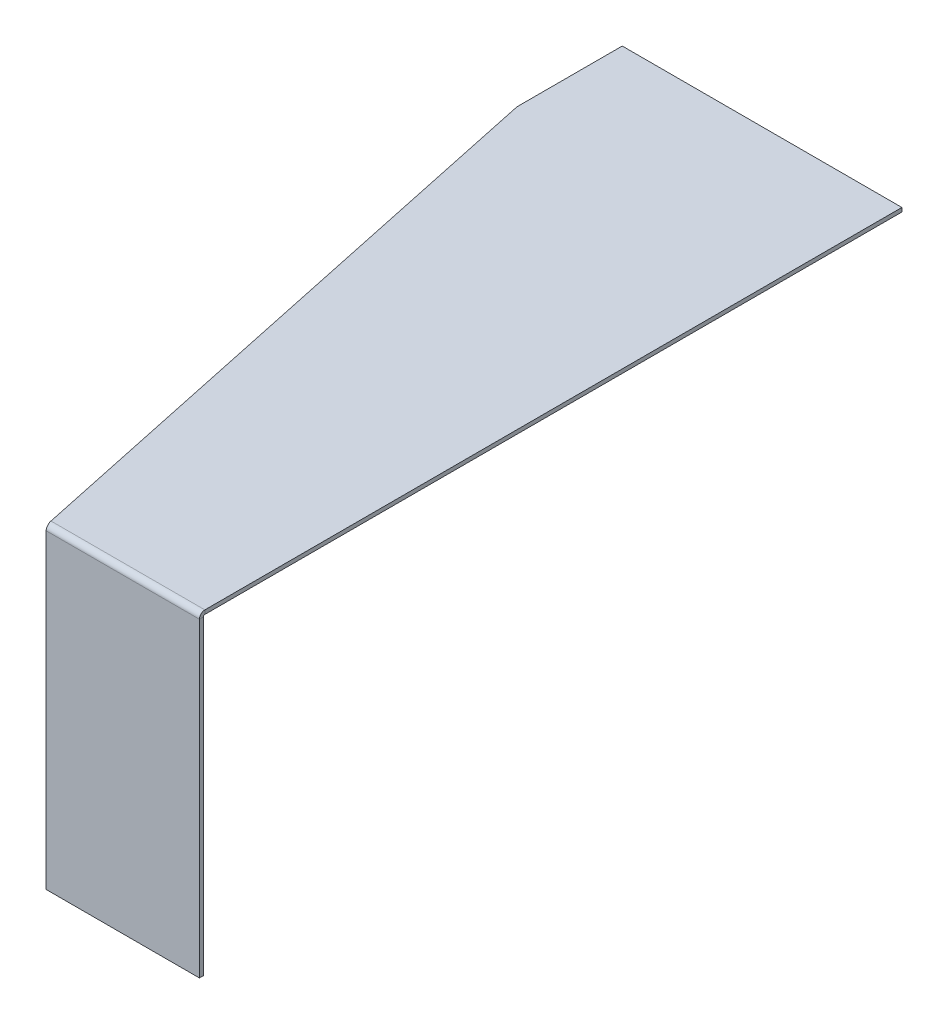
ISO-10303-21;
HEADER;
FILE_DESCRIPTION(('STEP AP214'),'2;1');
FILE_NAME('part.step','',(''),(''),'','','');
FILE_SCHEMA(('AUTOMOTIVE_DESIGN { 1 0 10303 214 1 1 1 1 }'));
ENDSEC;
DATA;
#1=APPLICATION_CONTEXT('core data for automotive mechanical design processes');
#2=APPLICATION_PROTOCOL_DEFINITION('international standard','automotive_design',2000,#1);
#3=PRODUCT_CONTEXT('',#1,'mechanical');
#4=PRODUCT('Part','Part','',(#3));
#5=PRODUCT_RELATED_PRODUCT_CATEGORY('part','',(#4));
#6=PRODUCT_DEFINITION_FORMATION('','',#4);
#7=PRODUCT_DEFINITION_CONTEXT('part definition',#1,'design');
#8=PRODUCT_DEFINITION('design','',#6,#7);
#9=PRODUCT_DEFINITION_SHAPE('','',#8);
#10=(LENGTH_UNIT() NAMED_UNIT(*) SI_UNIT(.MILLI.,.METRE.));
#11=(NAMED_UNIT(*) PLANE_ANGLE_UNIT() SI_UNIT($,.RADIAN.));
#12=(NAMED_UNIT(*) SI_UNIT($,.STERADIAN.) SOLID_ANGLE_UNIT());
#13=UNCERTAINTY_MEASURE_WITH_UNIT(LENGTH_MEASURE(1.E-05),#10,'distance_accuracy_value','');
#14=(GEOMETRIC_REPRESENTATION_CONTEXT(3) GLOBAL_UNCERTAINTY_ASSIGNED_CONTEXT((#13)) GLOBAL_UNIT_ASSIGNED_CONTEXT((#10,
#11,#12)) REPRESENTATION_CONTEXT('',''));
#15=CARTESIAN_POINT('',(0.,0.,0.));
#16=DIRECTION('',(0.,0.,1.));
#17=DIRECTION('',(1.,0.,0.));
#18=AXIS2_PLACEMENT_3D('',#15,#16,#17);
#19=CARTESIAN_POINT('',(-77.3703673668212,0.627322450556078,354.452092833276));
#20=DIRECTION('',(1.,0.,0.));
#21=DIRECTION('',(0.,1.,0.));
#22=AXIS2_PLACEMENT_3D('',#19,#20,#21);
#23=PLANE('',#22);
#24=DIRECTION('',(0.,-1.,0.));
#25=VECTOR('',#24,1.);
#26=CARTESIAN_POINT('',(-77.3703673668212,0.627322450556078,354.452092833276));
#27=LINE('',#26,#25);
#28=CARTESIAN_POINT('',(-77.3703673668212,-0.736599999999921,354.452092833276));
#29=VERTEX_POINT('',#28);
#30=CARTESIAN_POINT('',(-77.3703673668214,-157.506625406837,354.452092833275));
#31=VERTEX_POINT('',#30);
#32=EDGE_CURVE('E92',#29,#31,#27,.T.);
#33=ORIENTED_EDGE('',*,*,#32,.F.);
#34=DIRECTION('',(0.,0.,-1.));
#35=VECTOR('',#34,1.);
#36=CARTESIAN_POINT('',(-77.3703673668212,-0.736599999999976,354.452092833276));
#37=LINE('',#36,#35);
#38=CARTESIAN_POINT('',(-77.3703673668212,-0.736599999999976,352.452092833276));
#39=VERTEX_POINT('',#38);
#40=EDGE_CURVE('E12',#29,#39,#37,.T.);
#41=ORIENTED_EDGE('',*,*,#40,.T.);
#42=DIRECTION('',(0.,-1.,0.));
#43=VECTOR('',#42,1.);
#44=CARTESIAN_POINT('',(-77.3703673668212,0.627322450556078,352.452092833276));
#45=LINE('',#44,#43);
#46=CARTESIAN_POINT('',(-77.3703673668214,-157.506625406837,352.452092833275));
#47=VERTEX_POINT('',#46);
#48=EDGE_CURVE('E105',#39,#47,#45,.T.);
#49=ORIENTED_EDGE('',*,*,#48,.T.);
#50=DIRECTION('',(0.,0.,-1.));
#51=VECTOR('',#50,1.);
#52=CARTESIAN_POINT('',(-77.3703673668214,-157.506625406837,354.452092833275));
#53=LINE('',#52,#51);
#54=EDGE_CURVE('E329',#31,#47,#53,.T.);
#55=ORIENTED_EDGE('',*,*,#54,.F.);
#56=EDGE_LOOP('',(#33,#41,#49,#55));
#57=FACE_BOUND('',#56,.T.);
#58=ADVANCED_FACE('F89',(#57),#23,.F.);
#59=CARTESIAN_POINT('',(-2.24104759925885E-13,-157.506625406837,354.452092833275));
#60=DIRECTION('',(-1.,0.,0.));
#61=DIRECTION('',(0.,-1.,0.));
#62=AXIS2_PLACEMENT_3D('',#59,#60,#61);
#63=PLANE('',#62);
#64=DIRECTION('',(0.,1.,0.));
#65=VECTOR('',#64,1.);
#66=CARTESIAN_POINT('',(-2.2696394522702E-13,-157.506625406837,352.452092833275));
#67=LINE('',#66,#65);
#68=CARTESIAN_POINT('',(-2.2696394522702E-13,-157.506625406837,352.452092833275));
#69=VERTEX_POINT('',#68);
#70=CARTESIAN_POINT('',(0.,-0.736600000000032,352.452092833276));
#71=VERTEX_POINT('',#70);
#72=EDGE_CURVE('E112',#69,#71,#67,.T.);
#73=ORIENTED_EDGE('',*,*,#72,.T.);
#74=DIRECTION('',(0.,0.,1.));
#75=VECTOR('',#74,1.);
#76=CARTESIAN_POINT('',(0.,-0.736600000000032,354.452092833276));
#77=LINE('',#76,#75);
#78=CARTESIAN_POINT('',(0.,-0.736599999999881,354.452092833276));
#79=VERTEX_POINT('',#78);
#80=EDGE_CURVE('E343',#71,#79,#77,.T.);
#81=ORIENTED_EDGE('',*,*,#80,.T.);
#82=DIRECTION('',(0.,1.,0.));
#83=VECTOR('',#82,1.);
#84=CARTESIAN_POINT('',(-2.24104759925885E-13,-157.506625406837,354.452092833275));
#85=LINE('',#84,#83);
#86=CARTESIAN_POINT('',(-2.24104759925885E-13,-157.506625406837,354.452092833275));
#87=VERTEX_POINT('',#86);
#88=EDGE_CURVE('E332',#87,#79,#85,.T.);
#89=ORIENTED_EDGE('',*,*,#88,.F.);
#90=DIRECTION('',(0.,0.,-1.));
#91=VECTOR('',#90,1.);
#92=CARTESIAN_POINT('',(-2.24104759925885E-13,-157.506625406837,354.452092833275));
#93=LINE('',#92,#91);
#94=EDGE_CURVE('E333',#87,#69,#93,.T.);
#95=ORIENTED_EDGE('',*,*,#94,.T.);
#96=EDGE_LOOP('',(#73,#81,#89,#95));
#97=FACE_BOUND('',#96,.T.);
#98=ADVANCED_FACE('F316',(#97),#63,.F.);
#99=CARTESIAN_POINT('',(5.03862921591622E-13,353.706737734388,352.452092833277));
#100=DIRECTION('',(0.,0.,1.));
#101=DIRECTION('',(0.,-1.,0.));
#102=AXIS2_PLACEMENT_3D('',#99,#100,#101);
#103=PLANE('',#102);
#104=ORIENTED_EDGE('',*,*,#48,.F.);
#105=DIRECTION('',(1.,0.,0.));
#106=VECTOR('',#105,1.);
#107=CARTESIAN_POINT('',(2.51456863316356E-13,-0.736600000000032,352.452092833276));
#108=LINE('',#107,#106);
#109=EDGE_CURVE('E97',#39,#71,#108,.T.);
#110=ORIENTED_EDGE('',*,*,#109,.T.);
#111=ORIENTED_EDGE('',*,*,#72,.F.);
#112=DIRECTION('',(1.,0.,0.));
#113=VECTOR('',#112,1.);
#114=CARTESIAN_POINT('',(-77.3703673668214,-157.506625406837,352.452092833275));
#115=LINE('',#114,#113);
#116=EDGE_CURVE('E336',#47,#69,#115,.T.);
#117=ORIENTED_EDGE('',*,*,#116,.F.);
#118=EDGE_LOOP('',(#104,#110,#111,#117));
#119=FACE_BOUND('',#118,.T.);
#120=ADVANCED_FACE('F310',(#119),#103,.F.);
#121=CARTESIAN_POINT('',(-77.3703673668214,-157.506625406837,354.452092833275));
#122=DIRECTION('',(0.,1.,0.));
#123=DIRECTION('',(-1.,0.,0.));
#124=AXIS2_PLACEMENT_3D('',#121,#122,#123);
#125=PLANE('',#124);
#126=ORIENTED_EDGE('',*,*,#116,.T.);
#127=ORIENTED_EDGE('',*,*,#94,.F.);
#128=DIRECTION('',(1.,0.,0.));
#129=VECTOR('',#128,1.);
#130=CARTESIAN_POINT('',(-77.3703673668214,-157.506625406837,354.452092833275));
#131=LINE('',#130,#129);
#132=EDGE_CURVE('E331',#31,#87,#131,.T.);
#133=ORIENTED_EDGE('',*,*,#132,.F.);
#134=ORIENTED_EDGE('',*,*,#54,.T.);
#135=EDGE_LOOP('',(#126,#127,#133,#134));
#136=FACE_BOUND('',#135,.T.);
#137=ADVANCED_FACE('F306',(#136),#125,.F.);
#138=CARTESIAN_POINT('',(5.06722106892757E-13,353.706737734388,354.452092833277));
#139=DIRECTION('',(0.,0.,1.));
#140=DIRECTION('',(0.,-1.,0.));
#141=AXIS2_PLACEMENT_3D('',#138,#139,#140);
#142=PLANE('',#141);
#143=DIRECTION('',(1.,0.,0.));
#144=VECTOR('',#143,1.);
#145=CARTESIAN_POINT('',(2.54316048617491E-13,-0.736600000000032,354.452092833276));
#146=LINE('',#145,#144);
#147=EDGE_CURVE('E345',#29,#79,#146,.T.);
#148=ORIENTED_EDGE('',*,*,#147,.F.);
#149=ORIENTED_EDGE('',*,*,#32,.T.);
#150=ORIENTED_EDGE('',*,*,#132,.T.);
#151=ORIENTED_EDGE('',*,*,#88,.T.);
#152=EDGE_LOOP('',(#148,#149,#150,#151));
#153=FACE_BOUND('',#152,.T.);
#154=ADVANCED_FACE('F309',(#153),#142,.T.);
#155=CARTESIAN_POINT('',(-141.102892553405,2.,0.));
#156=DIRECTION('',(1.,0.,0.));
#157=DIRECTION('',(0.,0.,-1.));
#158=AXIS2_PLACEMENT_3D('',#155,#156,#157);
#159=PLANE('',#158);
#160=DIRECTION('',(0.,0.,1.));
#161=VECTOR('',#160,1.);
#162=CARTESIAN_POINT('',(-141.102892553405,0.,0.));
#163=LINE('',#162,#161);
#164=CARTESIAN_POINT('',(-141.102892553405,0.,0.));
#165=VERTEX_POINT('',#164);
#166=CARTESIAN_POINT('',(-141.102892553405,0.,53.0530579219572));
#167=VERTEX_POINT('',#166);
#168=EDGE_CURVE('E275',#165,#167,#163,.T.);
#169=ORIENTED_EDGE('',*,*,#168,.T.);
#170=DIRECTION('',(0.,-1.,0.));
#171=VECTOR('',#170,1.);
#172=CARTESIAN_POINT('',(-141.102892553405,2.,53.0530579219572));
#173=LINE('',#172,#171);
#174=CARTESIAN_POINT('',(-141.102892553405,2.,53.0530579219572));
#175=VERTEX_POINT('',#174);
#176=EDGE_CURVE('E249',#175,#167,#173,.T.);
#177=ORIENTED_EDGE('',*,*,#176,.F.);
#178=DIRECTION('',(0.,0.,1.));
#179=VECTOR('',#178,1.);
#180=CARTESIAN_POINT('',(-141.102892553405,2.,0.));
#181=LINE('',#180,#179);
#182=CARTESIAN_POINT('',(-141.102892553405,2.,0.));
#183=VERTEX_POINT('',#182);
#184=EDGE_CURVE('E260',#183,#175,#181,.T.);
#185=ORIENTED_EDGE('',*,*,#184,.F.);
#186=DIRECTION('',(0.,-1.,0.));
#187=VECTOR('',#186,1.);
#188=CARTESIAN_POINT('',(-141.102892553405,2.,0.));
#189=LINE('',#188,#187);
#190=EDGE_CURVE('E272',#183,#165,#189,.T.);
#191=ORIENTED_EDGE('',*,*,#190,.T.);
#192=EDGE_LOOP('',(#169,#177,#185,#191));
#193=FACE_BOUND('',#192,.T.);
#194=ADVANCED_FACE('F314',(#193),#159,.F.);
#195=CARTESIAN_POINT('',(0.,2.,0.));
#196=DIRECTION('',(0.,0.,1.));
#197=DIRECTION('',(1.,0.,0.));
#198=AXIS2_PLACEMENT_3D('',#195,#196,#197);
#199=PLANE('',#198);
#200=DIRECTION('',(-1.,0.,0.));
#201=VECTOR('',#200,1.);
#202=CARTESIAN_POINT('',(0.,0.,0.));
#203=LINE('',#202,#201);
#204=CARTESIAN_POINT('',(0.,0.,0.));
#205=VERTEX_POINT('',#204);
#206=EDGE_CURVE('E270',#205,#165,#203,.T.);
#207=ORIENTED_EDGE('',*,*,#206,.T.);
#208=ORIENTED_EDGE('',*,*,#190,.F.);
#209=DIRECTION('',(-1.,0.,0.));
#210=VECTOR('',#209,1.);
#211=CARTESIAN_POINT('',(0.,2.,0.));
#212=LINE('',#211,#210);
#213=CARTESIAN_POINT('',(0.,2.,0.));
#214=VERTEX_POINT('',#213);
#215=EDGE_CURVE('E262',#214,#183,#212,.T.);
#216=ORIENTED_EDGE('',*,*,#215,.F.);
#217=DIRECTION('',(0.,-1.,0.));
#218=VECTOR('',#217,1.);
#219=CARTESIAN_POINT('',(0.,2.,0.));
#220=LINE('',#219,#218);
#221=EDGE_CURVE('E266',#214,#205,#220,.T.);
#222=ORIENTED_EDGE('',*,*,#221,.T.);
#223=EDGE_LOOP('',(#207,#208,#216,#222));
#224=FACE_BOUND('',#223,.T.);
#225=ADVANCED_FACE('F378',(#224),#199,.F.);
#226=CARTESIAN_POINT('',(0.,2.,0.));
#227=DIRECTION('',(0.,1.,0.));
#228=DIRECTION('',(0.,0.,1.));
#229=AXIS2_PLACEMENT_3D('',#226,#227,#228);
#230=PLANE('',#229);
#231=DIRECTION('',(0.207786772011292,0.,0.978174144708971));
#232=VECTOR('',#231,1.);
#233=CARTESIAN_POINT('',(-141.102892553405,2.,53.0530579219572));
#234=LINE('',#233,#232);
#235=CARTESIAN_POINT('',(-77.6600959849897,2.,351.715492833276));
#236=VERTEX_POINT('',#235);
#237=EDGE_CURVE('E269',#175,#236,#234,.T.);
#238=ORIENTED_EDGE('',*,*,#237,.T.);
#239=DIRECTION('',(1.,0.,0.));
#240=VECTOR('',#239,1.);
#241=CARTESIAN_POINT('',(5.02809883645212E-13,2.,351.715492833276));
#242=LINE('',#241,#240);
#243=CARTESIAN_POINT('',(0.,1.99999999999999,351.715492833276));
#244=VERTEX_POINT('',#243);
#245=EDGE_CURVE('E198',#236,#244,#242,.T.);
#246=ORIENTED_EDGE('',*,*,#245,.T.);
#247=DIRECTION('',(0.,0.,-1.));
#248=VECTOR('',#247,1.);
#249=CARTESIAN_POINT('',(0.,2.,511.213363141224));
#250=LINE('',#249,#248);
#251=EDGE_CURVE('E264',#244,#214,#250,.T.);
#252=ORIENTED_EDGE('',*,*,#251,.T.);
#253=ORIENTED_EDGE('',*,*,#215,.T.);
#254=ORIENTED_EDGE('',*,*,#184,.T.);
#255=EDGE_LOOP('',(#238,#246,#252,#253,#254));
#256=FACE_BOUND('',#255,.T.);
#257=ADVANCED_FACE('F353',(#256),#230,.T.);
#258=CARTESIAN_POINT('',(0.,2.,511.213363141224));
#259=DIRECTION('',(-1.,0.,0.));
#260=DIRECTION('',(0.,0.,1.));
#261=AXIS2_PLACEMENT_3D('',#258,#259,#260);
#262=PLANE('',#261);
#263=DIRECTION('',(0.,1.,0.));
#264=VECTOR('',#263,1.);
#265=CARTESIAN_POINT('',(0.,2.00000000000001,351.715492833276));
#266=LINE('',#265,#264);
#267=CARTESIAN_POINT('',(0.,0.,351.715492833276));
#268=VERTEX_POINT('',#267);
#269=EDGE_CURVE('E277',#268,#244,#266,.T.);
#270=ORIENTED_EDGE('',*,*,#269,.F.);
#271=DIRECTION('',(0.,0.,-1.));
#272=VECTOR('',#271,1.);
#273=CARTESIAN_POINT('',(0.,0.,511.213363141224));
#274=LINE('',#273,#272);
#275=EDGE_CURVE('E258',#268,#205,#274,.T.);
#276=ORIENTED_EDGE('',*,*,#275,.T.);
#277=ORIENTED_EDGE('',*,*,#221,.F.);
#278=ORIENTED_EDGE('',*,*,#251,.F.);
#279=EDGE_LOOP('',(#270,#276,#277,#278));
#280=FACE_BOUND('',#279,.T.);
#281=ADVANCED_FACE('F376',(#280),#262,.F.);
#282=CARTESIAN_POINT('',(0.,0.,0.));
#283=DIRECTION('',(0.,1.,0.));
#284=DIRECTION('',(0.,0.,1.));
#285=AXIS2_PLACEMENT_3D('',#282,#283,#284);
#286=PLANE('',#285);
#287=DIRECTION('',(1.,0.,0.));
#288=VECTOR('',#287,1.);
#289=CARTESIAN_POINT('',(5.02809883645212E-13,0.,351.715492833276));
#290=LINE('',#289,#288);
#291=CARTESIAN_POINT('',(-77.6600959849897,0.,351.715492833276));
#292=VERTEX_POINT('',#291);
#293=EDGE_CURVE('E280',#292,#268,#290,.T.);
#294=ORIENTED_EDGE('',*,*,#293,.F.);
#295=DIRECTION('',(0.207786772011292,0.,0.978174144708971));
#296=VECTOR('',#295,1.);
#297=CARTESIAN_POINT('',(-141.102892553405,0.,53.0530579219572));
#298=LINE('',#297,#296);
#299=EDGE_CURVE('E257',#167,#292,#298,.T.);
#300=ORIENTED_EDGE('',*,*,#299,.F.);
#301=ORIENTED_EDGE('',*,*,#168,.F.);
#302=ORIENTED_EDGE('',*,*,#206,.F.);
#303=ORIENTED_EDGE('',*,*,#275,.F.);
#304=EDGE_LOOP('',(#294,#300,#301,#302,#303));
#305=FACE_BOUND('',#304,.T.);
#306=ADVANCED_FACE('F304',(#305),#286,.F.);
#307=CARTESIAN_POINT('',(-141.102892553405,2.,53.0530579219572));
#308=DIRECTION('',(0.978174144708971,0.,-0.207786772011292));
#309=DIRECTION('',(-0.207786772011292,0.,-0.978174144708971));
#310=AXIS2_PLACEMENT_3D('',#307,#308,#309);
#311=PLANE('',#310);
#312=CARTESIAN_POINT('',(-77.6600959849897,2.,351.715492833276));
#313=CARTESIAN_POINT('',(-77.6600959849897,0.,351.715492833276));
#314=B_SPLINE_CURVE_WITH_KNOTS('',1,(#312,#313),.UNSPECIFIED.,.F.,.F.,(2,2),(0.,1.),.UNSPECIFIED.);
#315=EDGE_CURVE('E182',#236,#292,#314,.T.);
#316=ORIENTED_EDGE('',*,*,#315,.F.);
#317=ORIENTED_EDGE('',*,*,#237,.F.);
#318=ORIENTED_EDGE('',*,*,#176,.T.);
#319=ORIENTED_EDGE('',*,*,#299,.T.);
#320=EDGE_LOOP('',(#316,#317,#318,#319));
#321=FACE_BOUND('',#320,.T.);
#322=ADVANCED_FACE('F230',(#321),#311,.F.);
#323=CARTESIAN_POINT('',(-77.3703673668212,-0.7366,351.715492833276));
#324=DIRECTION('',(-1.,0.,0.));
#325=DIRECTION('',(0.,0.,1.));
#326=AXIS2_PLACEMENT_3D('',#323,#324,#325);
#327=PLANE('',#326);
#328=CARTESIAN_POINT('',(-77.3703673668212,-0.215745144977946,352.236347688298));
#329=CARTESIAN_POINT('',(-77.3703673668212,1.19846841739527,353.650561250671));
#330=B_SPLINE_CURVE_WITH_KNOTS('',1,(#328,#329),.UNSPECIFIED.,.F.,.F.,(2,2),(0.,1.),.UNSPECIFIED.);
#331=CARTESIAN_POINT('',(-77.3703673668212,-0.215745144977946,352.236347688298));
#332=VERTEX_POINT('',#331);
#333=CARTESIAN_POINT('',(-77.3703673668212,1.19846841739525,353.650561250671));
#334=VERTEX_POINT('',#333);
#335=EDGE_CURVE('E167',#332,#334,#330,.T.);
#336=ORIENTED_EDGE('',*,*,#335,.F.);
#337=CARTESIAN_POINT('',(-77.3703673668212,-0.7366,351.715492833276));
#338=DIRECTION('',(1.,0.,0.));
#339=DIRECTION('',(0.,0.,-1.));
#340=AXIS2_PLACEMENT_3D('',#337,#338,#339);
#341=CIRCLE('',#340,0.7366);
#342=EDGE_CURVE('E365',#332,#39,#341,.T.);
#343=ORIENTED_EDGE('',*,*,#342,.T.);
#344=ORIENTED_EDGE('',*,*,#40,.F.);
#345=CARTESIAN_POINT('',(-77.3703673668212,-0.7366,351.715492833276));
#346=DIRECTION('',(1.,0.,0.));
#347=DIRECTION('',(0.,0.,-1.));
#348=AXIS2_PLACEMENT_3D('',#345,#346,#347);
#349=CIRCLE('',#348,2.73659999999998);
#350=EDGE_CURVE('E187',#334,#29,#349,.T.);
#351=ORIENTED_EDGE('',*,*,#350,.F.);
#352=EDGE_LOOP('',(#336,#343,#344,#351));
#353=FACE_BOUND('',#352,.T.);
#354=ADVANCED_FACE('F188',(#353),#327,.T.);
#355=CARTESIAN_POINT('',(0.,-0.7366,351.715492833276));
#356=DIRECTION('',(1.,0.,0.));
#357=DIRECTION('',(0.,0.,-1.));
#358=AXIS2_PLACEMENT_3D('',#355,#356,#357);
#359=PLANE('',#358);
#360=ORIENTED_EDGE('',*,*,#80,.F.);
#361=CARTESIAN_POINT('',(0.,-0.7366,351.715492833276));
#362=DIRECTION('',(1.,0.,0.));
#363=DIRECTION('',(0.,0.,-1.));
#364=AXIS2_PLACEMENT_3D('',#361,#362,#363);
#365=CIRCLE('',#364,0.7366);
#366=EDGE_CURVE('E360',#71,#268,#365,.F.);
#367=ORIENTED_EDGE('',*,*,#366,.T.);
#368=ORIENTED_EDGE('',*,*,#269,.T.);
#369=CARTESIAN_POINT('',(0.,-0.7366,351.715492833276));
#370=DIRECTION('',(-1.,0.,0.));
#371=DIRECTION('',(0.,0.,1.));
#372=AXIS2_PLACEMENT_3D('',#369,#370,#371);
#373=CIRCLE('',#372,2.73659999999999);
#374=EDGE_CURVE('E191',#79,#244,#373,.T.);
#375=ORIENTED_EDGE('',*,*,#374,.F.);
#376=EDGE_LOOP('',(#360,#367,#368,#375));
#377=FACE_BOUND('',#376,.T.);
#378=ADVANCED_FACE('F223',(#377),#359,.T.);
#379=CARTESIAN_POINT('',(-77.6600959849897,2.,351.715492833276));
#380=CARTESIAN_POINT('',(-77.6117993311259,2.00000000000001,352.073776369057));
#381=CARTESIAN_POINT('',(-77.5635197789335,1.92877362697054,352.431792093613));
#382=CARTESIAN_POINT('',(-77.4669435728773,1.65460383037035,353.093696534958));
#383=CARTESIAN_POINT('',(-77.4186640206849,1.45181313513358,353.397216532932));
#384=CARTESIAN_POINT('',(-77.3703673668212,1.19846841739527,353.650561250671));
#385=CARTESIAN_POINT('',(-77.6600959849897,0.,351.715492833276));
#386=CARTESIAN_POINT('',(-77.6118009214844,0.,351.811927446343));
#387=CARTESIAN_POINT('',(-77.5635197789335,-0.0191717263661158,351.908296324895));
#388=CARTESIAN_POINT('',(-77.4669435728773,-0.0929689463382384,352.086458574217));
#389=CARTESIAN_POINT('',(-77.4186624303265,-0.147555576136678,352.168158119456));
#390=CARTESIAN_POINT('',(-77.3703673668212,-0.215745144977946,352.236347688298));
#391=B_SPLINE_SURFACE_WITH_KNOTS('',1,3,((#379,#380,#381,#382,#383,#384),(#385,#386,#387,#388,
#389,#390)),.UNSPECIFIED.,.F.,.F.,.F.,(2,2),(4,2,4),(0.,1.),(0.,0.5,1.),.UNSPECIFIED.);
#392=CARTESIAN_POINT('',(-77.6600959849897,0.,351.715492833276));
#393=CARTESIAN_POINT('',(-77.6118009214844,0.,351.811927446343));
#394=CARTESIAN_POINT('',(-77.5635197789335,-0.0191717263661158,351.908296324895));
#395=CARTESIAN_POINT('',(-77.4669435728773,-0.0929689463382384,352.086458574217));
#396=CARTESIAN_POINT('',(-77.4186624303265,-0.147555576136678,352.168158119456));
#397=CARTESIAN_POINT('',(-77.3703673668212,-0.215745144977946,352.236347688298));
#398=B_SPLINE_CURVE_WITH_KNOTS('',3,(#392,#393,#394,#395,#396,#397),.UNSPECIFIED.,.F.,.F.,(4,2,
4),(0.,0.5,1.),.UNSPECIFIED.);
#399=EDGE_CURVE('E176',#292,#332,#398,.T.);
#400=CARTESIAN_POINT('',(-77.3703673668212,1.19846841739527,353.650561250671));
#401=CARTESIAN_POINT('',(-77.4186640206849,1.45181313513358,353.397216532932));
#402=CARTESIAN_POINT('',(-77.4669435728773,1.65460383037035,353.093696534958));
#403=CARTESIAN_POINT('',(-77.5635197789335,1.92877362697054,352.431792093613));
#404=CARTESIAN_POINT('',(-77.6117993311259,2.00000000000001,352.073776369057));
#405=CARTESIAN_POINT('',(-77.6600959849897,2.,351.715492833276));
#406=B_SPLINE_CURVE_WITH_KNOTS('',3,(#400,#401,#402,#403,#404,#405),.UNSPECIFIED.,.F.,.F.,(4,2,
4),(0.,0.5,1.),.UNSPECIFIED.);
#407=EDGE_CURVE('E173',#236,#334,#406,.F.);
#408=ORIENTED_EDGE('',*,*,#399,.T.);
#409=ORIENTED_EDGE('',*,*,#335,.T.);
#410=ORIENTED_EDGE('',*,*,#407,.F.);
#411=ORIENTED_EDGE('',*,*,#315,.T.);
#412=EDGE_LOOP('',(#408,#409,#410,#411));
#413=FACE_BOUND('',#412,.T.);
#414=ADVANCED_FACE('F170',(#413),#391,.T.);
#415=CARTESIAN_POINT('',(-116.563770701512,-0.7366,351.715492833276));
#416=DIRECTION('',(1.,0.,0.));
#417=DIRECTION('',(0.,0.,-1.));
#418=AXIS2_PLACEMENT_3D('',#415,#416,#417);
#419=CYLINDRICAL_SURFACE('',#418,2.7366);
#420=ORIENTED_EDGE('',*,*,#245,.F.);
#421=ORIENTED_EDGE('',*,*,#407,.T.);
#422=ORIENTED_EDGE('',*,*,#350,.T.);
#423=ORIENTED_EDGE('',*,*,#147,.T.);
#424=ORIENTED_EDGE('',*,*,#374,.T.);
#425=EDGE_LOOP('',(#420,#421,#422,#423,#424));
#426=FACE_BOUND('',#425,.T.);
#427=ADVANCED_FACE('F195',(#426),#419,.T.);
#428=CARTESIAN_POINT('',(-116.563770701512,-0.7366,351.715492833276));
#429=DIRECTION('',(1.,0.,0.));
#430=DIRECTION('',(0.,0.,-1.));
#431=AXIS2_PLACEMENT_3D('',#428,#429,#430);
#432=CYLINDRICAL_SURFACE('',#431,0.7366);
#433=ORIENTED_EDGE('',*,*,#293,.T.);
#434=ORIENTED_EDGE('',*,*,#366,.F.);
#435=ORIENTED_EDGE('',*,*,#109,.F.);
#436=ORIENTED_EDGE('',*,*,#342,.F.);
#437=ORIENTED_EDGE('',*,*,#399,.F.);
#438=EDGE_LOOP('',(#433,#434,#435,#436,#437));
#439=FACE_BOUND('',#438,.T.);
#440=ADVANCED_FACE('F213',(#439),#432,.F.);
#441=CLOSED_SHELL('',(#58,#98,#120,#137,#154,#194,#225,#257,#281,#306,#322,#354,#378,#414,#427,#440));
#442=MANIFOLD_SOLID_BREP('B2',#441);
#443=ADVANCED_BREP_SHAPE_REPRESENTATION('',(#18,#442),#14);
#444=SHAPE_DEFINITION_REPRESENTATION(#9,#443);
ENDSEC;
END-ISO-10303-21;
